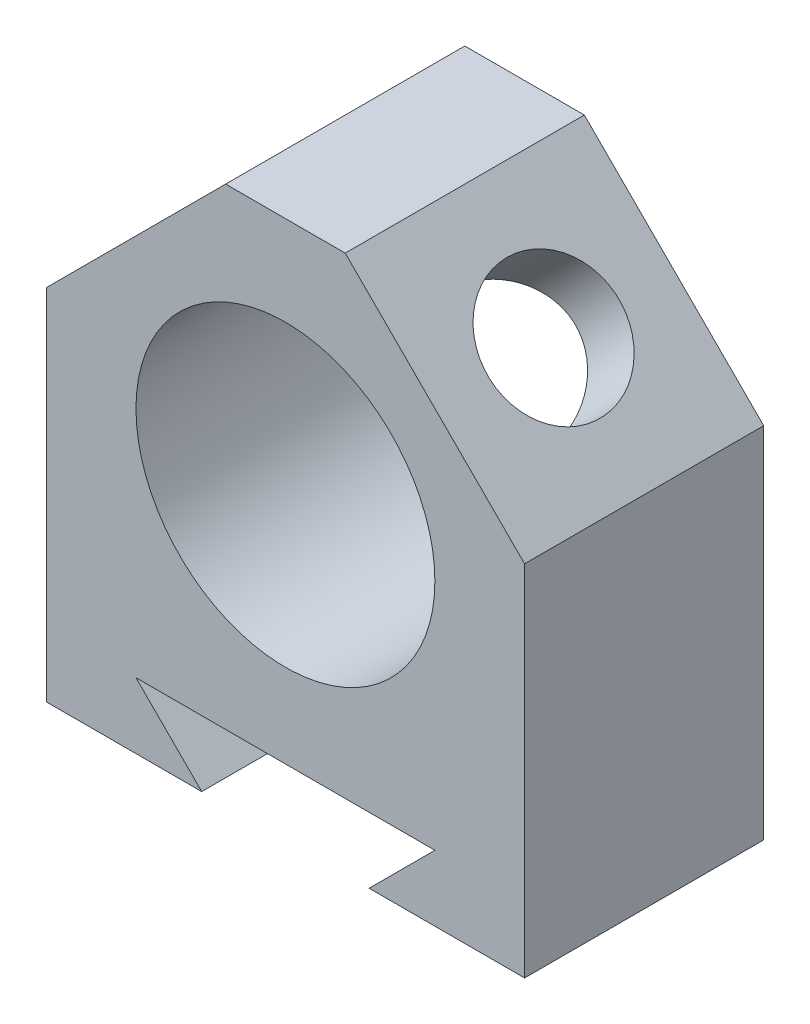
ISO-10303-21;
HEADER;
FILE_DESCRIPTION(('STEP AP214'),'2;1');
FILE_NAME('part.step','',(''),(''),'','','');
FILE_SCHEMA(('AUTOMOTIVE_DESIGN { 1 0 10303 214 1 1 1 1 }'));
ENDSEC;
DATA;
#1=APPLICATION_CONTEXT('core data for automotive mechanical design processes');
#2=APPLICATION_PROTOCOL_DEFINITION('international standard','automotive_design',2000,#1);
#3=PRODUCT_CONTEXT('',#1,'mechanical');
#4=PRODUCT('Part','Part','',(#3));
#5=PRODUCT_RELATED_PRODUCT_CATEGORY('part','',(#4));
#6=PRODUCT_DEFINITION_FORMATION('','',#4);
#7=PRODUCT_DEFINITION_CONTEXT('part definition',#1,'design');
#8=PRODUCT_DEFINITION('design','',#6,#7);
#9=PRODUCT_DEFINITION_SHAPE('','',#8);
#10=(LENGTH_UNIT() NAMED_UNIT(*) SI_UNIT(.MILLI.,.METRE.));
#11=(NAMED_UNIT(*) PLANE_ANGLE_UNIT() SI_UNIT($,.RADIAN.));
#12=(NAMED_UNIT(*) SI_UNIT($,.STERADIAN.) SOLID_ANGLE_UNIT());
#13=UNCERTAINTY_MEASURE_WITH_UNIT(LENGTH_MEASURE(1.E-05),#10,'distance_accuracy_value','');
#14=(GEOMETRIC_REPRESENTATION_CONTEXT(3) GLOBAL_UNCERTAINTY_ASSIGNED_CONTEXT((#13)) GLOBAL_UNIT_ASSIGNED_CONTEXT((#10,
#11,#12)) REPRESENTATION_CONTEXT('',''));
#15=CARTESIAN_POINT('',(0.,0.,0.));
#16=DIRECTION('',(0.,0.,1.));
#17=DIRECTION('',(1.,0.,0.));
#18=AXIS2_PLACEMENT_3D('',#15,#16,#17);
#19=CARTESIAN_POINT('',(44.4999999999999,44.5000000000001,-40.));
#20=DIRECTION('',(0.707106781186546,0.707106781186549,0.));
#21=DIRECTION('',(-0.707106781186549,0.707106781186546,0.));
#22=AXIS2_PLACEMENT_3D('',#19,#20,#21);
#23=PLANE('',#22);
#24=CARTESIAN_POINT('',(24.8492424049174,64.1507575950825,-20.));
#25=DIRECTION('',(0.707106781186546,0.707106781186549,0.));
#26=DIRECTION('',(-0.707106781186549,0.707106781186546,0.));
#27=AXIS2_PLACEMENT_3D('',#24,#25,#26);
#28=CIRCLE('',#27,11.);
#29=CARTESIAN_POINT('',(17.0710678118654,71.9289321881345,-20.));
#30=VERTEX_POINT('',#29);
#31=EDGE_CURVE('E220',#30,#30,#28,.T.);
#32=ORIENTED_EDGE('',*,*,#31,.F.);
#33=EDGE_LOOP('',(#32));
#34=FACE_BOUND('',#33,.T.);
#35=DIRECTION('',(-0.707106781186549,0.707106781186546,0.));
#36=VECTOR('',#35,1.);
#37=CARTESIAN_POINT('',(44.4999999999999,44.5000000000001,0.));
#38=LINE('',#37,#36);
#39=CARTESIAN_POINT('',(40.,49.,0.));
#40=VERTEX_POINT('',#39);
#41=CARTESIAN_POINT('',(9.99999999999989,79.,0.));
#42=VERTEX_POINT('',#41);
#43=EDGE_CURVE('E332',#40,#42,#38,.T.);
#44=ORIENTED_EDGE('',*,*,#43,.F.);
#45=DIRECTION('',(0.,0.,1.));
#46=VECTOR('',#45,1.);
#47=CARTESIAN_POINT('',(40.,49.,-40.));
#48=LINE('',#47,#46);
#49=CARTESIAN_POINT('',(40.,49.,-40.));
#50=VERTEX_POINT('',#49);
#51=EDGE_CURVE('E11',#50,#40,#48,.T.);
#52=ORIENTED_EDGE('',*,*,#51,.F.);
#53=DIRECTION('',(-0.707106781186549,0.707106781186546,0.));
#54=VECTOR('',#53,1.);
#55=CARTESIAN_POINT('',(44.4999999999999,44.5000000000001,-40.));
#56=LINE('',#55,#54);
#57=CARTESIAN_POINT('',(9.99999999999989,79.,-40.));
#58=VERTEX_POINT('',#57);
#59=EDGE_CURVE('E306',#50,#58,#56,.T.);
#60=ORIENTED_EDGE('',*,*,#59,.T.);
#61=DIRECTION('',(0.,0.,1.));
#62=VECTOR('',#61,1.);
#63=CARTESIAN_POINT('',(9.99999999999989,79.,-40.));
#64=LINE('',#63,#62);
#65=EDGE_CURVE('E47',#58,#42,#64,.T.);
#66=ORIENTED_EDGE('',*,*,#65,.T.);
#67=EDGE_LOOP('',(#44,#52,#60,#66));
#68=FACE_BOUND('',#67,.T.);
#69=ADVANCED_FACE('F43',(#34,#68),#23,.T.);
#70=CARTESIAN_POINT('',(40.,0.,-40.));
#71=DIRECTION('',(1.,0.,0.));
#72=DIRECTION('',(0.,0.,-1.));
#73=AXIS2_PLACEMENT_3D('',#70,#71,#72);
#74=PLANE('',#73);
#75=DIRECTION('',(0.,1.,0.));
#76=VECTOR('',#75,1.);
#77=CARTESIAN_POINT('',(40.,0.,0.));
#78=LINE('',#77,#76);
#79=CARTESIAN_POINT('',(40.,-11.,0.));
#80=VERTEX_POINT('',#79);
#81=EDGE_CURVE('E368',#80,#40,#78,.T.);
#82=ORIENTED_EDGE('',*,*,#81,.F.);
#83=DIRECTION('',(0.,0.,1.));
#84=VECTOR('',#83,1.);
#85=CARTESIAN_POINT('',(40.,-11.,-40.));
#86=LINE('',#85,#84);
#87=CARTESIAN_POINT('',(40.,-11.,-40.));
#88=VERTEX_POINT('',#87);
#89=EDGE_CURVE('E53',#88,#80,#86,.T.);
#90=ORIENTED_EDGE('',*,*,#89,.F.);
#91=DIRECTION('',(0.,1.,0.));
#92=VECTOR('',#91,1.);
#93=CARTESIAN_POINT('',(40.,0.,-40.));
#94=LINE('',#93,#92);
#95=EDGE_CURVE('E309',#88,#50,#94,.T.);
#96=ORIENTED_EDGE('',*,*,#95,.T.);
#97=ORIENTED_EDGE('',*,*,#51,.T.);
#98=EDGE_LOOP('',(#82,#90,#96,#97));
#99=FACE_BOUND('',#98,.T.);
#100=ADVANCED_FACE('F248',(#99),#74,.T.);
#101=CARTESIAN_POINT('',(0.,-11.,-40.));
#102=DIRECTION('',(0.,-1.,0.));
#103=DIRECTION('',(1.,0.,0.));
#104=AXIS2_PLACEMENT_3D('',#101,#102,#103);
#105=PLANE('',#104);
#106=DIRECTION('',(1.,0.,0.));
#107=VECTOR('',#106,1.);
#108=CARTESIAN_POINT('',(0.,-11.,0.));
#109=LINE('',#108,#107);
#110=CARTESIAN_POINT('',(14.,-11.,0.));
#111=VERTEX_POINT('',#110);
#112=EDGE_CURVE('E364',#111,#80,#109,.T.);
#113=ORIENTED_EDGE('',*,*,#112,.F.);
#114=DIRECTION('',(0.,0.,1.));
#115=VECTOR('',#114,1.);
#116=CARTESIAN_POINT('',(14.,-11.,-40.));
#117=LINE('',#116,#115);
#118=CARTESIAN_POINT('',(14.,-11.,-40.));
#119=VERTEX_POINT('',#118);
#120=EDGE_CURVE('E374',#119,#111,#117,.T.);
#121=ORIENTED_EDGE('',*,*,#120,.F.);
#122=DIRECTION('',(1.,0.,0.));
#123=VECTOR('',#122,1.);
#124=CARTESIAN_POINT('',(0.,-11.,-40.));
#125=LINE('',#124,#123);
#126=EDGE_CURVE('E318',#119,#88,#125,.T.);
#127=ORIENTED_EDGE('',*,*,#126,.T.);
#128=ORIENTED_EDGE('',*,*,#89,.T.);
#129=EDGE_LOOP('',(#113,#121,#127,#128));
#130=FACE_BOUND('',#129,.T.);
#131=ADVANCED_FACE('F253',(#130),#105,.T.);
#132=CARTESIAN_POINT('',(12.4999999999999,-12.5000000000001,-40.));
#133=DIRECTION('',(-0.707106781186544,0.707106781186551,0.));
#134=DIRECTION('',(-0.707106781186551,-0.707106781186544,0.));
#135=AXIS2_PLACEMENT_3D('',#132,#133,#134);
#136=PLANE('',#135);
#137=DIRECTION('',(-0.707106781186551,-0.707106781186544,0.));
#138=VECTOR('',#137,1.);
#139=CARTESIAN_POINT('',(12.4999999999999,-12.5000000000001,0.));
#140=LINE('',#139,#138);
#141=CARTESIAN_POINT('',(25.0000000000001,0.,0.));
#142=VERTEX_POINT('',#141);
#143=EDGE_CURVE('E360',#142,#111,#140,.T.);
#144=ORIENTED_EDGE('',*,*,#143,.F.);
#145=DIRECTION('',(0.,0.,1.));
#146=VECTOR('',#145,1.);
#147=CARTESIAN_POINT('',(25.0000000000001,0.,-40.));
#148=LINE('',#147,#146);
#149=CARTESIAN_POINT('',(25.0000000000001,0.,-40.));
#150=VERTEX_POINT('',#149);
#151=EDGE_CURVE('E377',#150,#142,#148,.T.);
#152=ORIENTED_EDGE('',*,*,#151,.F.);
#153=DIRECTION('',(-0.707106781186551,-0.707106781186544,0.));
#154=VECTOR('',#153,1.);
#155=CARTESIAN_POINT('',(12.4999999999999,-12.5000000000001,-40.));
#156=LINE('',#155,#154);
#157=EDGE_CURVE('E324',#150,#119,#156,.T.);
#158=ORIENTED_EDGE('',*,*,#157,.T.);
#159=ORIENTED_EDGE('',*,*,#120,.T.);
#160=EDGE_LOOP('',(#144,#152,#158,#159));
#161=FACE_BOUND('',#160,.T.);
#162=ADVANCED_FACE('F283',(#161),#136,.T.);
#163=CARTESIAN_POINT('',(0.,0.,-40.));
#164=DIRECTION('',(0.,1.,0.));
#165=DIRECTION('',(0.,0.,1.));
#166=AXIS2_PLACEMENT_3D('',#163,#164,#165);
#167=PLANE('',#166);
#168=DIRECTION('',(-1.,0.,0.));
#169=VECTOR('',#168,1.);
#170=CARTESIAN_POINT('',(0.,0.,0.));
#171=LINE('',#170,#169);
#172=CARTESIAN_POINT('',(-25.0000000000001,0.,0.));
#173=VERTEX_POINT('',#172);
#174=EDGE_CURVE('E356',#142,#173,#171,.T.);
#175=ORIENTED_EDGE('',*,*,#174,.T.);
#176=DIRECTION('',(0.,0.,1.));
#177=VECTOR('',#176,1.);
#178=CARTESIAN_POINT('',(-25.0000000000001,0.,-40.));
#179=LINE('',#178,#177);
#180=CARTESIAN_POINT('',(-25.0000000000001,0.,-40.));
#181=VERTEX_POINT('',#180);
#182=EDGE_CURVE('E380',#181,#173,#179,.T.);
#183=ORIENTED_EDGE('',*,*,#182,.F.);
#184=DIRECTION('',(-1.,0.,0.));
#185=VECTOR('',#184,1.);
#186=CARTESIAN_POINT('',(0.,0.,-40.));
#187=LINE('',#186,#185);
#188=EDGE_CURVE('E410',#150,#181,#187,.T.);
#189=ORIENTED_EDGE('',*,*,#188,.F.);
#190=ORIENTED_EDGE('',*,*,#151,.T.);
#191=EDGE_LOOP('',(#175,#183,#189,#190));
#192=FACE_BOUND('',#191,.T.);
#193=ADVANCED_FACE('F279',(#192),#167,.F.);
#194=CARTESIAN_POINT('',(-12.4999999999999,-12.5000000000001,-40.));
#195=DIRECTION('',(-0.707106781186544,-0.707106781186551,0.));
#196=DIRECTION('',(0.707106781186551,-0.707106781186544,0.));
#197=AXIS2_PLACEMENT_3D('',#194,#195,#196);
#198=PLANE('',#197);
#199=DIRECTION('',(0.707106781186551,-0.707106781186544,0.));
#200=VECTOR('',#199,1.);
#201=CARTESIAN_POINT('',(-12.4999999999999,-12.5000000000001,0.));
#202=LINE('',#201,#200);
#203=CARTESIAN_POINT('',(-14.,-11.,0.));
#204=VERTEX_POINT('',#203);
#205=EDGE_CURVE('E352',#173,#204,#202,.T.);
#206=ORIENTED_EDGE('',*,*,#205,.T.);
#207=DIRECTION('',(0.,0.,1.));
#208=VECTOR('',#207,1.);
#209=CARTESIAN_POINT('',(-14.,-11.,-40.));
#210=LINE('',#209,#208);
#211=CARTESIAN_POINT('',(-14.,-11.,-40.));
#212=VERTEX_POINT('',#211);
#213=EDGE_CURVE('E384',#212,#204,#210,.T.);
#214=ORIENTED_EDGE('',*,*,#213,.F.);
#215=DIRECTION('',(0.707106781186551,-0.707106781186544,0.));
#216=VECTOR('',#215,1.);
#217=CARTESIAN_POINT('',(-12.4999999999999,-12.5000000000001,-40.));
#218=LINE('',#217,#216);
#219=EDGE_CURVE('E413',#181,#212,#218,.T.);
#220=ORIENTED_EDGE('',*,*,#219,.F.);
#221=ORIENTED_EDGE('',*,*,#182,.T.);
#222=EDGE_LOOP('',(#206,#214,#220,#221));
#223=FACE_BOUND('',#222,.T.);
#224=ADVANCED_FACE('F275',(#223),#198,.F.);
#225=CARTESIAN_POINT('',(0.,-11.,-40.));
#226=DIRECTION('',(0.,1.,0.));
#227=DIRECTION('',(-1.,0.,0.));
#228=AXIS2_PLACEMENT_3D('',#225,#226,#227);
#229=PLANE('',#228);
#230=DIRECTION('',(-1.,0.,0.));
#231=VECTOR('',#230,1.);
#232=CARTESIAN_POINT('',(0.,-11.,0.));
#233=LINE('',#232,#231);
#234=CARTESIAN_POINT('',(-40.,-11.,0.));
#235=VERTEX_POINT('',#234);
#236=EDGE_CURVE('E348',#204,#235,#233,.T.);
#237=ORIENTED_EDGE('',*,*,#236,.T.);
#238=DIRECTION('',(0.,0.,1.));
#239=VECTOR('',#238,1.);
#240=CARTESIAN_POINT('',(-40.,-11.,-40.));
#241=LINE('',#240,#239);
#242=CARTESIAN_POINT('',(-40.,-11.,-40.));
#243=VERTEX_POINT('',#242);
#244=EDGE_CURVE('E388',#243,#235,#241,.T.);
#245=ORIENTED_EDGE('',*,*,#244,.F.);
#246=DIRECTION('',(-1.,0.,0.));
#247=VECTOR('',#246,1.);
#248=CARTESIAN_POINT('',(0.,-11.,-40.));
#249=LINE('',#248,#247);
#250=EDGE_CURVE('E419',#212,#243,#249,.T.);
#251=ORIENTED_EDGE('',*,*,#250,.F.);
#252=ORIENTED_EDGE('',*,*,#213,.T.);
#253=EDGE_LOOP('',(#237,#245,#251,#252));
#254=FACE_BOUND('',#253,.T.);
#255=ADVANCED_FACE('F271',(#254),#229,.F.);
#256=CARTESIAN_POINT('',(-40.,0.,-40.));
#257=DIRECTION('',(1.,0.,0.));
#258=DIRECTION('',(0.,1.,0.));
#259=AXIS2_PLACEMENT_3D('',#256,#257,#258);
#260=PLANE('',#259);
#261=DIRECTION('',(0.,1.,0.));
#262=VECTOR('',#261,1.);
#263=CARTESIAN_POINT('',(-40.,0.,0.));
#264=LINE('',#263,#262);
#265=CARTESIAN_POINT('',(-40.,49.,0.));
#266=VERTEX_POINT('',#265);
#267=EDGE_CURVE('E344',#235,#266,#264,.T.);
#268=ORIENTED_EDGE('',*,*,#267,.T.);
#269=DIRECTION('',(0.,0.,1.));
#270=VECTOR('',#269,1.);
#271=CARTESIAN_POINT('',(-40.,49.,-40.));
#272=LINE('',#271,#270);
#273=CARTESIAN_POINT('',(-40.,49.,-40.));
#274=VERTEX_POINT('',#273);
#275=EDGE_CURVE('E392',#274,#266,#272,.T.);
#276=ORIENTED_EDGE('',*,*,#275,.F.);
#277=DIRECTION('',(0.,1.,0.));
#278=VECTOR('',#277,1.);
#279=CARTESIAN_POINT('',(-40.,0.,-40.));
#280=LINE('',#279,#278);
#281=EDGE_CURVE('E423',#243,#274,#280,.T.);
#282=ORIENTED_EDGE('',*,*,#281,.F.);
#283=ORIENTED_EDGE('',*,*,#244,.T.);
#284=EDGE_LOOP('',(#268,#276,#282,#283));
#285=FACE_BOUND('',#284,.T.);
#286=ADVANCED_FACE('F267',(#285),#260,.F.);
#287=CARTESIAN_POINT('',(-44.5000000000001,44.4999999999999,-40.));
#288=DIRECTION('',(0.707106781186549,-0.707106781186546,0.));
#289=DIRECTION('',(0.707106781186546,0.707106781186549,0.));
#290=AXIS2_PLACEMENT_3D('',#287,#288,#289);
#291=PLANE('',#290);
#292=DIRECTION('',(0.,0.,-1.));
#293=VECTOR('',#292,1.);
#294=CARTESIAN_POINT('',(-17.7781745930521,71.221825406948,-14.2264973081037));
#295=LINE('',#294,#293);
#296=CARTESIAN_POINT('',(-17.7781745930521,71.221825406948,-14.2264973081037));
#297=VERTEX_POINT('',#296);
#298=CARTESIAN_POINT('',(-17.7781745930521,71.221825406948,-25.7735026918963));
#299=VERTEX_POINT('',#298);
#300=EDGE_CURVE('E468',#297,#299,#295,.T.);
#301=ORIENTED_EDGE('',*,*,#300,.F.);
#302=DIRECTION('',(0.612372435695794,0.612372435695795,-0.5));
#303=VECTOR('',#302,1.);
#304=CARTESIAN_POINT('',(-24.8492424049176,64.1507575950825,-8.45299461620748));
#305=LINE('',#304,#303);
#306=CARTESIAN_POINT('',(-24.8492424049176,64.1507575950825,-8.45299461620748));
#307=VERTEX_POINT('',#306);
#308=EDGE_CURVE('E473',#307,#297,#305,.T.);
#309=ORIENTED_EDGE('',*,*,#308,.F.);
#310=DIRECTION('',(0.612372435695794,0.612372435695795,0.5));
#311=VECTOR('',#310,1.);
#312=CARTESIAN_POINT('',(-31.920310216783,57.079689783217,-14.2264973081037));
#313=LINE('',#312,#311);
#314=CARTESIAN_POINT('',(-31.920310216783,57.079689783217,-14.2264973081038));
#315=VERTEX_POINT('',#314);
#316=EDGE_CURVE('E187',#315,#307,#313,.T.);
#317=ORIENTED_EDGE('',*,*,#316,.F.);
#318=DIRECTION('',(0.,0.,1.));
#319=VECTOR('',#318,1.);
#320=CARTESIAN_POINT('',(-31.920310216783,57.079689783217,-25.7735026918963));
#321=LINE('',#320,#319);
#322=CARTESIAN_POINT('',(-31.920310216783,57.079689783217,-25.7735026918963));
#323=VERTEX_POINT('',#322);
#324=EDGE_CURVE('E61',#323,#315,#321,.T.);
#325=ORIENTED_EDGE('',*,*,#324,.F.);
#326=DIRECTION('',(-0.612372435695794,-0.612372435695795,0.5));
#327=VECTOR('',#326,1.);
#328=CARTESIAN_POINT('',(-24.8492424049176,64.1507575950825,-31.5470053837925));
#329=LINE('',#328,#327);
#330=CARTESIAN_POINT('',(-24.8492424049176,64.1507575950825,-31.5470053837925));
#331=VERTEX_POINT('',#330);
#332=EDGE_CURVE('E458',#331,#323,#329,.T.);
#333=ORIENTED_EDGE('',*,*,#332,.F.);
#334=DIRECTION('',(-0.612372435695793,-0.612372435695796,-0.5));
#335=VECTOR('',#334,1.);
#336=CARTESIAN_POINT('',(-17.7781745930521,71.221825406948,-25.7735026918963));
#337=LINE('',#336,#335);
#338=EDGE_CURVE('E463',#299,#331,#337,.T.);
#339=ORIENTED_EDGE('',*,*,#338,.F.);
#340=EDGE_LOOP('',(#301,#309,#317,#325,#333,#339));
#341=FACE_BOUND('',#340,.T.);
#342=DIRECTION('',(0.707106781186546,0.707106781186549,0.));
#343=VECTOR('',#342,1.);
#344=CARTESIAN_POINT('',(-44.5000000000001,44.4999999999999,0.));
#345=LINE('',#344,#343);
#346=CARTESIAN_POINT('',(-10.0000000000001,79.,0.));
#347=VERTEX_POINT('',#346);
#348=EDGE_CURVE('E340',#266,#347,#345,.T.);
#349=ORIENTED_EDGE('',*,*,#348,.T.);
#350=DIRECTION('',(0.,0.,1.));
#351=VECTOR('',#350,1.);
#352=CARTESIAN_POINT('',(-10.0000000000001,79.,-40.));
#353=LINE('',#352,#351);
#354=CARTESIAN_POINT('',(-10.0000000000001,79.,-40.));
#355=VERTEX_POINT('',#354);
#356=EDGE_CURVE('E323',#355,#347,#353,.T.);
#357=ORIENTED_EDGE('',*,*,#356,.F.);
#358=DIRECTION('',(0.707106781186546,0.707106781186549,0.));
#359=VECTOR('',#358,1.);
#360=CARTESIAN_POINT('',(-44.5000000000001,44.4999999999999,-40.));
#361=LINE('',#360,#359);
#362=EDGE_CURVE('E427',#274,#355,#361,.T.);
#363=ORIENTED_EDGE('',*,*,#362,.F.);
#364=ORIENTED_EDGE('',*,*,#275,.T.);
#365=EDGE_LOOP('',(#349,#357,#363,#364));
#366=FACE_BOUND('',#365,.T.);
#367=ADVANCED_FACE('F264',(#341,#366),#291,.F.);
#368=CARTESIAN_POINT('',(0.,39.,-40.));
#369=DIRECTION('',(0.,0.,1.));
#370=DIRECTION('',(1.,0.,0.));
#371=AXIS2_PLACEMENT_3D('',#368,#369,#370);
#372=CYLINDRICAL_SURFACE('',#371,25.);
#373=CARTESIAN_POINT('',(0.,39.,-8.57608767714123));
#374=DIRECTION('',(-0.353553390593273,-0.353553390593274,0.866025403784439));
#375=DIRECTION('',(0.612372435695794,0.612372435695796,0.5));
#376=AXIS2_PLACEMENT_3D('',#373,#374,#375);
#377=ELLIPSE('',#376,28.8675134594813,25.);
#378=CARTESIAN_POINT('',(-17.5262690821482,56.8277842723132,-8.45299461620748));
#379=VERTEX_POINT('',#378);
#380=CARTESIAN_POINT('',(-23.1871263312994,48.3465058977334,-14.2264973081037));
#381=VERTEX_POINT('',#380);
#382=EDGE_CURVE('E170',#379,#381,#377,.T.);
#383=ORIENTED_EDGE('',*,*,#382,.F.);
#384=CARTESIAN_POINT('',(0.,39.,-8.32990155527374));
#385=DIRECTION('',(0.353553390593273,0.353553390593274,0.866025403784439));
#386=DIRECTION('',(-0.612372435695794,-0.612372435695795,0.5));
#387=AXIS2_PLACEMENT_3D('',#384,#385,#386);
#388=ELLIPSE('',#387,28.8675134594813,25.);
#389=CARTESIAN_POINT('',(-8.91339190772002,62.3570427216159,-14.2264973081037));
#390=VERTEX_POINT('',#389);
#391=EDGE_CURVE('E69',#390,#379,#388,.T.);
#392=ORIENTED_EDGE('',*,*,#391,.F.);
#393=DIRECTION('',(0.,0.,1.));
#394=VECTOR('',#393,1.);
#395=CARTESIAN_POINT('',(-8.91339190772003,62.3570427216159,-40.));
#396=LINE('',#395,#394);
#397=CARTESIAN_POINT('',(-8.91339190772003,62.3570427216159,-25.7735026918963));
#398=VERTEX_POINT('',#397);
#399=EDGE_CURVE('E189',#398,#390,#396,.T.);
#400=ORIENTED_EDGE('',*,*,#399,.F.);
#401=CARTESIAN_POINT('',(0.,39.,-31.6700984447262));
#402=DIRECTION('',(0.353553390593273,0.353553390593274,-0.866025403784439));
#403=DIRECTION('',(0.612372435695794,0.612372435695795,0.5));
#404=AXIS2_PLACEMENT_3D('',#401,#402,#403);
#405=ELLIPSE('',#404,28.8675134594813,25.);
#406=CARTESIAN_POINT('',(-17.5262690821482,56.8277842723131,-31.5470053837925));
#407=VERTEX_POINT('',#406);
#408=EDGE_CURVE('E183',#407,#398,#405,.T.);
#409=ORIENTED_EDGE('',*,*,#408,.F.);
#410=CARTESIAN_POINT('',(0.,39.,-31.4239123228588));
#411=DIRECTION('',(-0.353553390593273,-0.353553390593275,-0.866025403784438));
#412=DIRECTION('',(-0.612372435695793,-0.612372435695795,0.5));
#413=AXIS2_PLACEMENT_3D('',#410,#411,#412);
#414=ELLIPSE('',#413,28.8675134594813,25.);
#415=CARTESIAN_POINT('',(-23.1871263312993,48.3465058977333,-25.7735026918963));
#416=VERTEX_POINT('',#415);
#417=EDGE_CURVE('E178',#416,#407,#414,.T.);
#418=ORIENTED_EDGE('',*,*,#417,.F.);
#419=DIRECTION('',(0.,0.,1.));
#420=VECTOR('',#419,1.);
#421=CARTESIAN_POINT('',(-23.1871263312993,48.3465058977333,-40.));
#422=LINE('',#421,#420);
#423=EDGE_CURVE('E160',#381,#416,#422,.F.);
#424=ORIENTED_EDGE('',*,*,#423,.F.);
#425=EDGE_LOOP('',(#383,#392,#400,#409,#418,#424));
#426=FACE_BOUND('',#425,.T.);
#427=CARTESIAN_POINT('',(7.87081573251166,62.7286801087807,-20.));
#428=CARTESIAN_POINT('',(7.8708191898994,62.7286803005709,-20.290935245428));
#429=CARTESIAN_POINT('',(7.88309919171173,62.7246166163851,-20.5819548589753));
#430=CARTESIAN_POINT('',(7.93199197001687,62.7083138387281,-21.1618381686437));
#431=CARTESIAN_POINT('',(7.96861954616506,62.6960697727947,-21.4507004453692));
#432=CARTESIAN_POINT('',(8.06559814996753,62.6632362067397,-22.0245807598623));
#433=CARTESIAN_POINT('',(8.12600056926089,62.6426286250434,-22.309589077183));
#434=CARTESIAN_POINT('',(8.26939994322573,62.5928542461499,-22.8731075020126));
#435=CARTESIAN_POINT('',(8.35239899701644,62.5636866537489,-23.1516170032016));
#436=CARTESIAN_POINT('',(8.53911572441413,62.4966653503633,-23.6990422971341));
#437=CARTESIAN_POINT('',(8.64273523948297,62.4588526698049,-23.96799668582));
#438=CARTESIAN_POINT('',(8.86932526875306,62.3741243523501,-24.4961339848239));
#439=CARTESIAN_POINT('',(8.99229640480345,62.3272084229167,-24.7553165808009));
#440=CARTESIAN_POINT('',(9.25582016191939,62.2239058685706,-25.262462842263));
#441=CARTESIAN_POINT('',(9.39636546179428,62.1675231840641,-25.5104311212661));
#442=CARTESIAN_POINT('',(9.69337847182461,62.0448309709655,-25.9941741540421));
#443=CARTESIAN_POINT('',(9.8498515962998,61.9785180631757,-26.2299447201136));
#444=CARTESIAN_POINT('',(10.1876282547992,61.8308645545627,-26.7031242361765));
#445=CARTESIAN_POINT('',(10.3698860156499,61.7488253855858,-26.9396347158049));
#446=CARTESIAN_POINT('',(10.748375735792,61.5724612311717,-27.3963385736198));
#447=CARTESIAN_POINT('',(10.944608377397,61.4781356456721,-27.6165311540237));
#448=CARTESIAN_POINT('',(11.3491099880014,61.2766419926917,-28.0395630744183));
#449=CARTESIAN_POINT('',(11.557385964763,61.1694664083332,-28.2423921371869));
#450=CARTESIAN_POINT('',(11.9837453445264,60.9419282271605,-28.6293239655709));
#451=CARTESIAN_POINT('',(12.2018253918995,60.8215701223576,-28.8134330691257));
#452=CARTESIAN_POINT('',(12.6577375948512,60.5604804811095,-29.1711933698559));
#453=CARTESIAN_POINT('',(12.8960015446296,60.419001928795,-29.3437519093813));
#454=CARTESIAN_POINT('',(13.3787628471161,60.1208236016132,-29.6654668084492));
#455=CARTESIAN_POINT('',(13.6232604803519,59.9641231408361,-29.814622112633));
#456=CARTESIAN_POINT('',(14.1158641303655,59.6356480835135,-30.0880863953018));
#457=CARTESIAN_POINT('',(14.3639687726495,59.4638791095806,-30.2124045851495));
#458=CARTESIAN_POINT('',(14.8612675533626,59.1056360673909,-30.4349388432375));
#459=CARTESIAN_POINT('',(15.1104616034074,58.9191631719013,-30.5331569904609));
#460=CARTESIAN_POINT('',(15.5932810414423,58.5432303405978,-30.6975580254021));
#461=CARTESIAN_POINT('',(15.8269913816803,58.3545328867718,-30.7652360150581));
#462=CARTESIAN_POINT('',(16.2908420799884,57.9657590449206,-30.8755403697026));
#463=CARTESIAN_POINT('',(16.5209825585811,57.7656830421174,-30.9181675822345));
#464=CARTESIAN_POINT('',(16.9754723791323,57.3555710672862,-30.9778242132374));
#465=CARTESIAN_POINT('',(17.199824036769,57.1455391763425,-30.9948640283889));
#466=CARTESIAN_POINT('',(17.6408484399036,56.7170812155761,-31.0031416550966));
#467=CARTESIAN_POINT('',(17.8575215517233,56.498655547236,-30.9943806992164));
#468=CARTESIAN_POINT('',(18.2664936427243,56.0709262748255,-30.9526724204165));
#469=CARTESIAN_POINT('',(18.4594346012106,55.8620633579514,-30.9214716237625));
#470=CARTESIAN_POINT('',(18.8359640907073,55.4403875490288,-30.8371701618123));
#471=CARTESIAN_POINT('',(19.0195531442526,55.2275748785799,-30.7840707216075));
#472=CARTESIAN_POINT('',(19.3764278533928,54.7997360179143,-30.656491216084));
#473=CARTESIAN_POINT('',(19.5497132488586,54.5847097719737,-30.5820106112468));
#474=CARTESIAN_POINT('',(19.8852674628602,54.1542280149303,-30.4123604875304));
#475=CARTESIAN_POINT('',(20.0475359486703,53.9387724910648,-30.3171903441631));
#476=CARTESIAN_POINT('',(20.3624280741783,53.506682467008,-30.105738604682));
#477=CARTESIAN_POINT('',(20.5149150680866,53.2900641252242,-29.9892208057195));
#478=CARTESIAN_POINT('',(20.8079099208113,52.8599649148059,-29.7367342912882));
#479=CARTESIAN_POINT('',(20.9484134745055,52.6464851963455,-29.6007586320536));
#480=CARTESIAN_POINT('',(21.2173318588372,52.2245013970671,-29.3103531953435));
#481=CARTESIAN_POINT('',(21.3457456527534,52.0159977440991,-29.1559218378268));
#482=CARTESIAN_POINT('',(21.5905788355132,51.6057125704318,-28.8296003069003));
#483=CARTESIAN_POINT('',(21.7069974689517,51.4039314736318,-28.6577090352902));
#484=CARTESIAN_POINT('',(21.9364186709828,50.9938659610172,-28.2838381261986));
#485=CARTESIAN_POINT('',(22.0484986004642,50.7862420155737,-28.0805664221864));
#486=CARTESIAN_POINT('',(22.259440163939,50.3828443378378,-27.6561824906296));
#487=CARTESIAN_POINT('',(22.3583012398419,50.1870711060649,-27.4350695104706));
#488=CARTESIAN_POINT('',(22.5433177451671,49.8093970813319,-26.9761313025198));
#489=CARTESIAN_POINT('',(22.6294681319493,49.6275018078409,-26.738299496913));
#490=CARTESIAN_POINT('',(22.7895411587423,49.2797599702359,-26.2472295911094));
#491=CARTESIAN_POINT('',(22.8634622400958,49.1139154529493,-25.9939895327075));
#492=CARTESIAN_POINT('',(23.0024099703399,48.7939176168157,-25.4626658222331));
#493=CARTESIAN_POINT('',(23.0669407449087,48.6405341681172,-25.1839874453697));
#494=CARTESIAN_POINT('',(23.1838261508847,48.3559539693139,-24.613214389925));
#495=CARTESIAN_POINT('',(23.2361860694966,48.2247475919365,-24.3211256033159));
#496=CARTESIAN_POINT('',(23.3292546646902,47.9867797800286,-23.72547023389));
#497=CARTESIAN_POINT('',(23.3699677807662,47.880009034307,-23.4219080745465));
#498=CARTESIAN_POINT('',(23.4401930018995,47.6929488131867,-22.8054700128642));
#499=CARTESIAN_POINT('',(23.4697061762955,47.6126568097686,-22.4925950027677));
#500=CARTESIAN_POINT('',(23.5162799920275,47.4846273548857,-21.8809135047697));
#501=CARTESIAN_POINT('',(23.5340317604861,47.4350966506731,-21.5825344645928));
#502=CARTESIAN_POINT('',(23.560229488285,47.3616458145065,-20.9822327149978));
#503=CARTESIAN_POINT('',(23.568675860146,47.3377245472531,-20.6803101632681));
#504=CARTESIAN_POINT('',(23.5763499057886,47.3160001270997,-20.0755173076968));
#505=CARTESIAN_POINT('',(23.5755808445693,47.3181877239095,-19.7726473775279));
#506=CARTESIAN_POINT('',(23.5648238532469,47.3486129574567,-19.1683921486751));
#507=CARTESIAN_POINT('',(23.5548362646644,47.3768496291491,-18.8670067954076));
#508=CARTESIAN_POINT('',(23.5266073397903,47.4557877861644,-18.2900070934248));
#509=CARTESIAN_POINT('',(23.5090198147401,47.5047041673717,-18.0141139205241));
#510=CARTESIAN_POINT('',(23.4656710421102,47.6235887692482,-17.4674617863785));
#511=CARTESIAN_POINT('',(23.4399069962108,47.6935641967076,-17.196704616541));
#512=CARTESIAN_POINT('',(23.3799980648813,47.8534153175873,-16.6621530858113));
#513=CARTESIAN_POINT('',(23.3458547946221,47.9432871754647,-16.3983573938722));
#514=CARTESIAN_POINT('',(23.2689000546026,48.1416410894989,-15.8790573810902));
#515=CARTESIAN_POINT('',(23.2260851832731,48.2501304460982,-15.6235563597353));
#516=CARTESIAN_POINT('',(23.1294926961848,48.4891445369535,-15.1117391648044));
#517=CARTESIAN_POINT('',(23.0753306373909,48.620402562835,-14.8558381517592));
#518=CARTESIAN_POINT('',(22.956835826954,48.8998343875192,-14.3557664630213));
#519=CARTESIAN_POINT('',(22.8924986169745,49.0480155934236,-14.1116009907997));
#520=CARTESIAN_POINT('',(22.7532316720926,49.3595150357772,-13.6362394033551));
#521=CARTESIAN_POINT('',(22.6783001501195,49.5228358243987,-13.40504548541));
#522=CARTESIAN_POINT('',(22.5174181547793,49.8628380463704,-12.9567402233921));
#523=CARTESIAN_POINT('',(22.4314671487434,50.0395201254201,-12.7396295608516));
#524=CARTESIAN_POINT('',(22.2399534162398,50.4207673415667,-12.3018405094764));
#525=CARTESIAN_POINT('',(22.1333257029772,50.6264142712977,-12.0825672742869));
#526=CARTESIAN_POINT('',(21.906056133326,51.0491606422616,-11.6633296510501));
#527=CARTESIAN_POINT('',(21.7854189492461,51.266256252126,-11.4633588659406));
#528=CARTESIAN_POINT('',(21.5296483177232,51.7098312654572,-11.0838440474867));
#529=CARTESIAN_POINT('',(21.3945070907199,51.9363156644324,-10.9043110838693));
#530=CARTESIAN_POINT('',(21.1096205537683,52.3961573148861,-10.5671981293546));
#531=CARTESIAN_POINT('',(20.9598816493453,52.6295115207652,-10.4096085826489));
#532=CARTESIAN_POINT('',(20.6449261971843,53.1020583239574,-10.1168496382332));
#533=CARTESIAN_POINT('',(20.479633316546,53.3412749460235,-9.98180091041534));
#534=CARTESIAN_POINT('',(20.1345063139493,53.8219152442564,-9.7364145220783));
#535=CARTESIAN_POINT('',(19.9546719878423,54.0633389513664,-9.62607720856682));
#536=CARTESIAN_POINT('',(19.5811820093341,54.5457487310982,-9.43134683930033));
#537=CARTESIAN_POINT('',(19.3875339338852,54.7867349704087,-9.34693969343662));
#538=CARTESIAN_POINT('',(18.9873285453419,55.2658769310665,-9.20497783213924));
#539=CARTESIAN_POINT('',(18.7807723138038,55.5040328875745,-9.14742087037797));
#540=CARTESIAN_POINT('',(18.3721955573327,55.9572514283578,-9.06317121207637));
#541=CARTESIAN_POINT('',(18.171012688216,56.1726987187345,-9.03447412587037));
#542=CARTESIAN_POINT('',(17.7601674384459,56.5972638165831,-9.00092447668515));
#543=CARTESIAN_POINT('',(17.5505055113962,56.8063819616011,-8.99607063986221));
#544=CARTESIAN_POINT('',(17.1243366848329,57.2166012389593,-9.01023924046104));
#545=CARTESIAN_POINT('',(16.9078309849241,57.4177037624912,-9.02925751585591));
#546=CARTESIAN_POINT('',(16.4697180105151,57.8105009089292,-9.09092381557239));
#547=CARTESIAN_POINT('',(16.248110777579,58.0021956084446,-9.13357164743979));
#548=CARTESIAN_POINT('',(15.8106561039419,58.3675268315232,-9.23982590046769));
#549=CARTESIAN_POINT('',(15.5949340020289,58.5415792319653,-9.30252338562209));
#550=CARTESIAN_POINT('',(15.1622804058041,58.8791483345139,-9.4486105578026));
#551=CARTESIAN_POINT('',(14.9453489552637,59.0426654152818,-9.53199950061123));
#552=CARTESIAN_POINT('',(14.5120239944419,59.3586115313544,-9.7187073444406));
#553=CARTESIAN_POINT('',(14.2956304573715,59.5110411299724,-9.82202523197131));
#554=CARTESIAN_POINT('',(13.8650101427065,59.8045530326767,-10.0477832083144));
#555=CARTESIAN_POINT('',(13.6507842288753,59.945630957814,-10.1702306233413));
#556=CARTESIAN_POINT('',(13.2160734470802,60.2227470565942,-10.4396333452795));
#557=CARTESIAN_POINT('',(12.9957814564532,60.3582186285636,-10.5874826719309));
#558=CARTESIAN_POINT('',(12.5613307350248,60.6165881360042,-10.9021544450536));
#559=CARTESIAN_POINT('',(12.3471743258504,60.7394813560754,-11.0689839577293));
#560=CARTESIAN_POINT('',(11.9268878648886,60.9728727877726,-11.4205488655666));
#561=CARTESIAN_POINT('',(11.7207592841075,61.0833687346542,-11.6052875209329));
#562=CARTESIAN_POINT('',(11.3183922733092,61.2922720552791,-11.991607833507));
#563=CARTESIAN_POINT('',(11.1221542851389,61.3906788892418,-12.193190242116));
#564=CARTESIAN_POINT('',(10.7264567736996,61.5830742346529,-12.6286096804724));
#565=CARTESIAN_POINT('',(10.5279512260739,61.6761112300324,-12.8637364424545));
#566=CARTESIAN_POINT('',(10.1469618250815,61.849134187479,-13.3509752684462));
#567=CARTESIAN_POINT('',(9.96447127628029,61.9291256156642,-13.6030801557013));
#568=CARTESIAN_POINT('',(9.61755965790854,62.0767877494317,-14.1232977303345));
#569=CARTESIAN_POINT('',(9.45315891625105,62.1444446493727,-14.3914279141678));
#570=CARTESIAN_POINT('',(9.14510647098918,62.2678869510267,-14.9418122928389));
#571=CARTESIAN_POINT('',(9.00144512954952,62.3236778727368,-15.2240598445321));
#572=CARTESIAN_POINT('',(8.73701919956243,62.4240160092667,-15.8013134592731));
#573=CARTESIAN_POINT('',(8.61627317707539,62.4685541166189,-16.0963296318716));
#574=CARTESIAN_POINT('',(8.40011171337301,62.5467906686571,-16.6967525776599));
#575=CARTESIAN_POINT('',(8.30468341999878,62.5804946149857,-17.0021539897673));
#576=CARTESIAN_POINT('',(8.14127198926777,62.6374103646018,-17.6202853992786));
#577=CARTESIAN_POINT('',(8.07321550551295,62.6606502280599,-17.9329934030769));
#578=CARTESIAN_POINT('',(7.96575678023363,62.6970457466326,-18.5637092285411));
#579=CARTESIAN_POINT('',(7.92633255240681,62.710209139746,-18.8817127914577));
#580=CARTESIAN_POINT('',(7.89139446204568,62.7218459123103,-19.3337726750942));
#581=CARTESIAN_POINT('',(7.88368188486327,62.7244091036927,-19.4668794191463));
#582=CARTESIAN_POINT('',(7.87339166185736,62.7278261799094,-19.7333181968878));
#583=CARTESIAN_POINT('',(7.87081414782282,62.728680020874,-19.8666502362714));
#584=CARTESIAN_POINT('',(7.87081573251166,62.7286801087807,-20.));
#585=B_SPLINE_CURVE_WITH_KNOTS('',3,(#427,#428,#429,#430,#431,#432,#433,#434,#435,#436,#437,
#438,#439,#440,#441,#442,#443,#444,#445,#446,#447,#448,#449,#450,#451,#452,#453,#454,#455,#456,
#457,#458,#459,#460,#461,#462,#463,#464,#465,#466,#467,#468,#469,#470,#471,#472,#473,#474,#475,
#476,#477,#478,#479,#480,#481,#482,#483,#484,#485,#486,#487,#488,#489,#490,#491,#492,#493,#494,
#495,#496,#497,#498,#499,#500,#501,#502,#503,#504,#505,#506,#507,#508,#509,#510,#511,#512,#513,
#514,#515,#516,#517,#518,#519,#520,#521,#522,#523,#524,#525,#526,#527,#528,#529,#530,#531,#532,
#533,#534,#535,#536,#537,#538,#539,#540,#541,#542,#543,#544,#545,#546,#547,#548,#549,#550,#551,
#552,#553,#554,#555,#556,#557,#558,#559,#560,#561,#562,#563,#564,#565,#566,#567,#568,#569,#570,
#571,#572,#573,#574,#575,#576,#577,#578,#579,#580,#581,#582,#583,#584),.UNSPECIFIED.,.T.,.F.,(4,
2,2,2,2,2,2,2,2,2,2,2,2,2,2,2,2,2,2,2,2,2,2,2,2,2,2,2,2,2,2,2,2,2,2,2,2,2,2,2,2,2,2,2,2,2,2,2,2,
2,2,2,2,2,2,2,2,2,2,2,2,2,2,2,2,2,2,2,2,2,2,2,2,2,2,2,2,2,4),(0.,0.872666866193214,
1.74586466795789,2.62096042997996,3.49613751196545,4.36724411201634,5.23837871011167,
6.10915160529047,6.9802214956808,7.90817553411272,8.83617491034828,9.76471981250885,
10.6929492868798,11.6710294275952,12.6491536617455,13.6269144619302,14.6045973558087,
15.5271043444958,16.4495801201885,17.3716809736698,18.2937377769341,19.1508678043482,
20.0079498872311,20.865053599077,21.72218318513,22.5894423127334,23.4570117073503,
24.3246554301614,25.1923537601946,26.1256092122481,27.0589040532442,27.9925681651536,
28.9263511834922,29.8988516966331,30.8709289479219,31.8426351704051,32.8142485937739,
33.7219829265161,34.6296770165604,35.5370495229367,36.4443884150651,37.2856724950098,
38.1272448057501,38.9686550230802,39.8103959380048,40.6874366503403,41.564862716277,
42.4424369652412,43.3200536511082,44.2758519329727,45.2313323564213,46.1873278584401,
47.1429057376026,48.1034456269104,49.0639990036636,50.0240295014453,50.9839796671917,
51.8713571684645,52.758687260404,53.645862670647,54.5330308552725,55.3846265639111,
56.2361916473236,57.0877134356545,57.9395621423526,58.8322835436598,59.7253383938925,
60.618556123419,61.5118137207532,62.4751142372951,63.4380100862546,64.4019771441736,
65.3654947835668,66.3297897659632,67.2935942980198,68.2547986998558,69.2152642238384,
69.6152395990654,70.0152252393389),.UNSPECIFIED.);
#586=CARTESIAN_POINT('',(7.87081573251166,62.7286801087807,-20.));
#587=VERTEX_POINT('',#586);
#588=EDGE_CURVE('E207',#587,#587,#585,.T.);
#589=ORIENTED_EDGE('',*,*,#588,.F.);
#590=EDGE_LOOP('',(#589));
#591=FACE_BOUND('',#590,.T.);
#592=CARTESIAN_POINT('',(0.,39.,-40.));
#593=DIRECTION('',(0.,0.,1.));
#594=DIRECTION('',(1.,0.,0.));
#595=AXIS2_PLACEMENT_3D('',#592,#593,#594);
#596=CIRCLE('',#595,25.);
#597=CARTESIAN_POINT('',(25.,39.,-40.));
#598=VERTEX_POINT('',#597);
#599=EDGE_CURVE('E301',#598,#598,#596,.T.);
#600=ORIENTED_EDGE('',*,*,#599,.F.);
#601=EDGE_LOOP('',(#600));
#602=FACE_BOUND('',#601,.T.);
#603=CARTESIAN_POINT('',(0.,39.,0.));
#604=DIRECTION('',(0.,0.,1.));
#605=DIRECTION('',(1.,0.,0.));
#606=AXIS2_PLACEMENT_3D('',#603,#604,#605);
#607=CIRCLE('',#606,25.);
#608=CARTESIAN_POINT('',(25.,39.,0.));
#609=VERTEX_POINT('',#608);
#610=EDGE_CURVE('E328',#609,#609,#607,.T.);
#611=ORIENTED_EDGE('',*,*,#610,.T.);
#612=EDGE_LOOP('',(#611));
#613=FACE_BOUND('',#612,.T.);
#614=ADVANCED_FACE('F45',(#426,#591,#602,#613),#372,.F.);
#615=CARTESIAN_POINT('',(9.86710713135597E-13,78.9999999999999,-40.));
#616=DIRECTION('',(0.,1.,0.));
#617=DIRECTION('',(-1.,0.,0.));
#618=AXIS2_PLACEMENT_3D('',#615,#616,#617);
#619=PLANE('',#618);
#620=DIRECTION('',(-1.,0.,0.));
#621=VECTOR('',#620,1.);
#622=CARTESIAN_POINT('',(9.86710713135597E-13,78.9999999999999,0.));
#623=LINE('',#622,#621);
#624=EDGE_CURVE('E336',#42,#347,#623,.T.);
#625=ORIENTED_EDGE('',*,*,#624,.F.);
#626=ORIENTED_EDGE('',*,*,#65,.F.);
#627=DIRECTION('',(-1.,0.,0.));
#628=VECTOR('',#627,1.);
#629=CARTESIAN_POINT('',(9.86710713135597E-13,78.9999999999999,-40.));
#630=LINE('',#629,#628);
#631=EDGE_CURVE('E311',#58,#355,#630,.T.);
#632=ORIENTED_EDGE('',*,*,#631,.T.);
#633=ORIENTED_EDGE('',*,*,#356,.T.);
#634=EDGE_LOOP('',(#625,#626,#632,#633));
#635=FACE_BOUND('',#634,.T.);
#636=ADVANCED_FACE('F259',(#635),#619,.T.);
#637=CARTESIAN_POINT('',(0.,0.,-40.));
#638=DIRECTION('',(0.,0.,1.));
#639=DIRECTION('',(1.,0.,0.));
#640=AXIS2_PLACEMENT_3D('',#637,#638,#639);
#641=PLANE('',#640);
#642=ORIENTED_EDGE('',*,*,#599,.T.);
#643=EDGE_LOOP('',(#642));
#644=FACE_BOUND('',#643,.T.);
#645=ORIENTED_EDGE('',*,*,#59,.F.);
#646=ORIENTED_EDGE('',*,*,#95,.F.);
#647=ORIENTED_EDGE('',*,*,#126,.F.);
#648=ORIENTED_EDGE('',*,*,#157,.F.);
#649=ORIENTED_EDGE('',*,*,#188,.T.);
#650=ORIENTED_EDGE('',*,*,#219,.T.);
#651=ORIENTED_EDGE('',*,*,#250,.T.);
#652=ORIENTED_EDGE('',*,*,#281,.T.);
#653=ORIENTED_EDGE('',*,*,#362,.T.);
#654=ORIENTED_EDGE('',*,*,#631,.F.);
#655=EDGE_LOOP('',(#645,#646,#647,#648,#649,#650,#651,#652,#653,#654));
#656=FACE_BOUND('',#655,.T.);
#657=ADVANCED_FACE('F262',(#644,#656),#641,.F.);
#658=CARTESIAN_POINT('',(0.,0.,0.));
#659=DIRECTION('',(0.,0.,1.));
#660=DIRECTION('',(1.,0.,0.));
#661=AXIS2_PLACEMENT_3D('',#658,#659,#660);
#662=PLANE('',#661);
#663=ORIENTED_EDGE('',*,*,#610,.F.);
#664=EDGE_LOOP('',(#663));
#665=FACE_BOUND('',#664,.T.);
#666=ORIENTED_EDGE('',*,*,#43,.T.);
#667=ORIENTED_EDGE('',*,*,#624,.T.);
#668=ORIENTED_EDGE('',*,*,#348,.F.);
#669=ORIENTED_EDGE('',*,*,#267,.F.);
#670=ORIENTED_EDGE('',*,*,#236,.F.);
#671=ORIENTED_EDGE('',*,*,#205,.F.);
#672=ORIENTED_EDGE('',*,*,#174,.F.);
#673=ORIENTED_EDGE('',*,*,#143,.T.);
#674=ORIENTED_EDGE('',*,*,#112,.T.);
#675=ORIENTED_EDGE('',*,*,#81,.T.);
#676=EDGE_LOOP('',(#666,#667,#668,#669,#670,#671,#672,#673,#674,#675));
#677=FACE_BOUND('',#676,.T.);
#678=ADVANCED_FACE('F291',(#665,#677),#662,.T.);
#679=CARTESIAN_POINT('',(-45.1517575950824,-5.85024240491763,-20.));
#680=DIRECTION('',(0.707106781186546,0.707106781186549,0.));
#681=DIRECTION('',(-0.707106781186549,0.707106781186546,0.));
#682=AXIS2_PLACEMENT_3D('',#679,#680,#681);
#683=CYLINDRICAL_SURFACE('',#682,11.);
#684=ORIENTED_EDGE('',*,*,#31,.T.);
#685=EDGE_LOOP('',(#684));
#686=FACE_BOUND('',#685,.T.);
#687=ORIENTED_EDGE('',*,*,#588,.T.);
#688=EDGE_LOOP('',(#687));
#689=FACE_BOUND('',#688,.T.);
#690=ADVANCED_FACE('F222',(#686,#689),#683,.F.);
#691=CARTESIAN_POINT('',(45.1517575950826,-5.85024240491744,-8.45299461620748));
#692=DIRECTION('',(0.353553390593273,0.353553390593274,0.866025403784439));
#693=DIRECTION('',(0.,-0.925820099772551,0.377964473009228));
#694=AXIS2_PLACEMENT_3D('',#691,#692,#693);
#695=PLANE('',#694);
#696=ORIENTED_EDGE('',*,*,#391,.T.);
#697=DIRECTION('',(-0.707106781186549,0.707106781186546,0.));
#698=VECTOR('',#697,1.);
#699=CARTESIAN_POINT('',(45.1517575950826,-5.85024240491744,-8.45299461620748));
#700=LINE('',#699,#698);
#701=EDGE_CURVE('E166',#379,#307,#700,.T.);
#702=ORIENTED_EDGE('',*,*,#701,.T.);
#703=ORIENTED_EDGE('',*,*,#308,.T.);
#704=DIRECTION('',(-0.707106781186549,0.707106781186546,0.));
#705=VECTOR('',#704,1.);
#706=CARTESIAN_POINT('',(52.222825406948,1.22082540694804,-14.2264973081037));
#707=LINE('',#706,#705);
#708=EDGE_CURVE('E203',#390,#297,#707,.T.);
#709=ORIENTED_EDGE('',*,*,#708,.F.);
#710=EDGE_LOOP('',(#696,#702,#703,#709));
#711=FACE_BOUND('',#710,.T.);
#712=ADVANCED_FACE('F227',(#711),#695,.F.);
#713=CARTESIAN_POINT('',(52.222825406948,1.22082540694804,-14.2264973081037));
#714=DIRECTION('',(0.707106781186546,0.707106781186549,0.));
#715=DIRECTION('',(-0.707106781186549,0.707106781186546,0.));
#716=AXIS2_PLACEMENT_3D('',#713,#714,#715);
#717=PLANE('',#716);
#718=ORIENTED_EDGE('',*,*,#399,.T.);
#719=ORIENTED_EDGE('',*,*,#708,.T.);
#720=ORIENTED_EDGE('',*,*,#300,.T.);
#721=DIRECTION('',(-0.707106781186549,0.707106781186546,0.));
#722=VECTOR('',#721,1.);
#723=CARTESIAN_POINT('',(52.222825406948,1.22082540694804,-25.7735026918963));
#724=LINE('',#723,#722);
#725=EDGE_CURVE('E200',#398,#299,#724,.T.);
#726=ORIENTED_EDGE('',*,*,#725,.F.);
#727=EDGE_LOOP('',(#718,#719,#720,#726));
#728=FACE_BOUND('',#727,.T.);
#729=ADVANCED_FACE('F230',(#728),#717,.F.);
#730=CARTESIAN_POINT('',(52.222825406948,1.22082540694804,-25.7735026918963));
#731=DIRECTION('',(0.353553390593273,0.353553390593274,-0.866025403784439));
#732=DIRECTION('',(0.,0.925820099772551,0.377964473009228));
#733=AXIS2_PLACEMENT_3D('',#730,#731,#732);
#734=PLANE('',#733);
#735=ORIENTED_EDGE('',*,*,#408,.T.);
#736=ORIENTED_EDGE('',*,*,#725,.T.);
#737=ORIENTED_EDGE('',*,*,#338,.T.);
#738=DIRECTION('',(-0.707106781186549,0.707106781186546,0.));
#739=VECTOR('',#738,1.);
#740=CARTESIAN_POINT('',(45.1517575950826,-5.85024240491745,-31.5470053837925));
#741=LINE('',#740,#739);
#742=EDGE_CURVE('E197',#407,#331,#741,.T.);
#743=ORIENTED_EDGE('',*,*,#742,.F.);
#744=EDGE_LOOP('',(#735,#736,#737,#743));
#745=FACE_BOUND('',#744,.T.);
#746=ADVANCED_FACE('F233',(#745),#734,.F.);
#747=CARTESIAN_POINT('',(45.1517575950826,-5.85024240491745,-31.5470053837925));
#748=DIRECTION('',(-0.353553390593273,-0.353553390593275,-0.866025403784438));
#749=DIRECTION('',(0.,0.925820099772551,-0.377964473009228));
#750=AXIS2_PLACEMENT_3D('',#747,#748,#749);
#751=PLANE('',#750);
#752=ORIENTED_EDGE('',*,*,#417,.T.);
#753=ORIENTED_EDGE('',*,*,#742,.T.);
#754=ORIENTED_EDGE('',*,*,#332,.T.);
#755=DIRECTION('',(-0.707106781186549,0.707106781186546,0.));
#756=VECTOR('',#755,1.);
#757=CARTESIAN_POINT('',(38.0806897832171,-12.9213102167829,-25.7735026918963));
#758=LINE('',#757,#756);
#759=EDGE_CURVE('E167',#416,#323,#758,.T.);
#760=ORIENTED_EDGE('',*,*,#759,.F.);
#761=EDGE_LOOP('',(#752,#753,#754,#760));
#762=FACE_BOUND('',#761,.T.);
#763=ADVANCED_FACE('F237',(#762),#751,.F.);
#764=CARTESIAN_POINT('',(38.0806897832171,-12.9213102167829,-25.7735026918963));
#765=DIRECTION('',(-0.707106781186546,-0.707106781186549,0.));
#766=DIRECTION('',(0.707106781186549,-0.707106781186546,0.));
#767=AXIS2_PLACEMENT_3D('',#764,#765,#766);
#768=PLANE('',#767);
#769=ORIENTED_EDGE('',*,*,#423,.T.);
#770=ORIENTED_EDGE('',*,*,#759,.T.);
#771=ORIENTED_EDGE('',*,*,#324,.T.);
#772=DIRECTION('',(-0.707106781186549,0.707106781186546,0.));
#773=VECTOR('',#772,1.);
#774=CARTESIAN_POINT('',(38.0806897832171,-12.9213102167829,-14.2264973081037));
#775=LINE('',#774,#773);
#776=EDGE_CURVE('E156',#381,#315,#775,.T.);
#777=ORIENTED_EDGE('',*,*,#776,.F.);
#778=EDGE_LOOP('',(#769,#770,#771,#777));
#779=FACE_BOUND('',#778,.T.);
#780=ADVANCED_FACE('F158',(#779),#768,.F.);
#781=CARTESIAN_POINT('',(38.0806897832171,-12.9213102167829,-14.2264973081037));
#782=DIRECTION('',(-0.353553390593273,-0.353553390593274,0.866025403784439));
#783=DIRECTION('',(0.,-0.925820099772551,-0.377964473009227));
#784=AXIS2_PLACEMENT_3D('',#781,#782,#783);
#785=PLANE('',#784);
#786=ORIENTED_EDGE('',*,*,#382,.T.);
#787=ORIENTED_EDGE('',*,*,#776,.T.);
#788=ORIENTED_EDGE('',*,*,#316,.T.);
#789=ORIENTED_EDGE('',*,*,#701,.F.);
#790=EDGE_LOOP('',(#786,#787,#788,#789));
#791=FACE_BOUND('',#790,.T.);
#792=ADVANCED_FACE('F171',(#791),#785,.F.);
#793=CLOSED_SHELL('',(#69,#100,#131,#162,#193,#224,#255,#286,#367,#614,#636,#657,#678,#690,#712,
#729,#746,#763,#780,#792));
#794=MANIFOLD_SOLID_BREP('B2',#793);
#795=ADVANCED_BREP_SHAPE_REPRESENTATION('',(#18,#794),#14);
#796=SHAPE_DEFINITION_REPRESENTATION(#9,#795);
ENDSEC;
END-ISO-10303-21;
